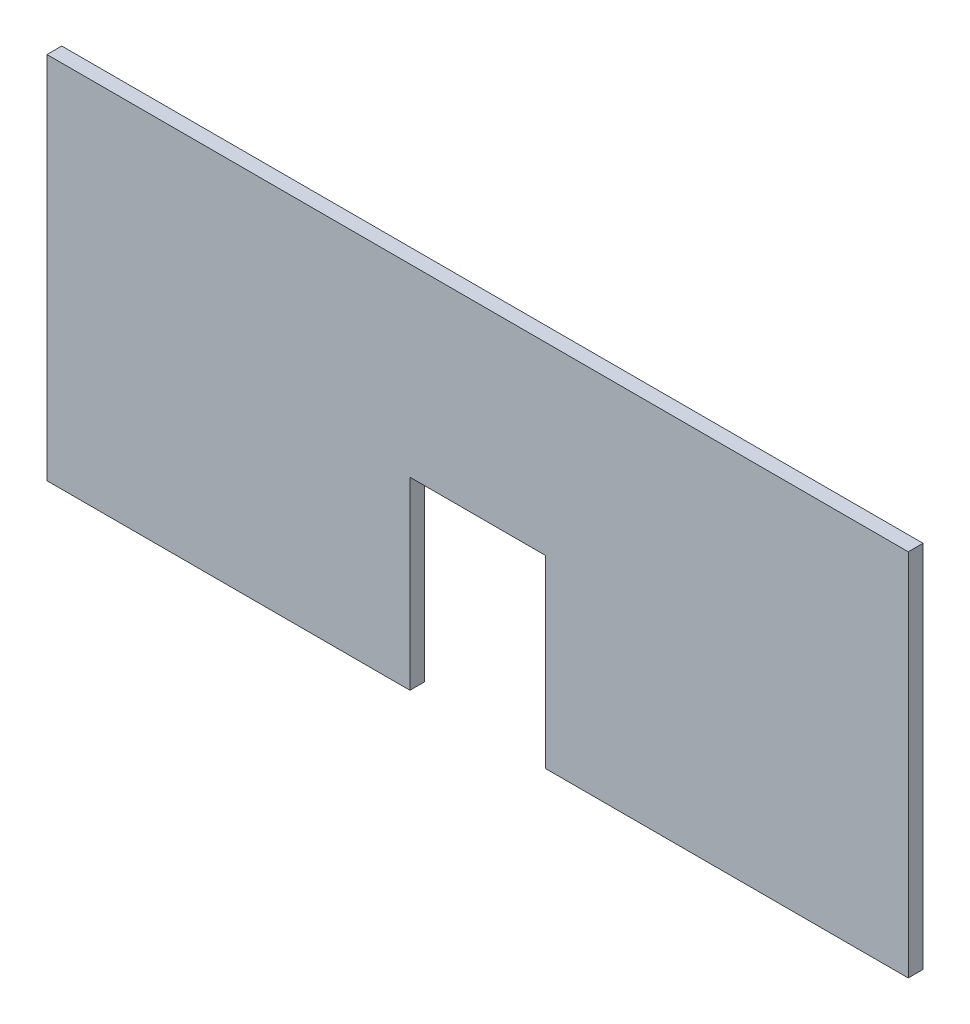
ISO-10303-21;
HEADER;
FILE_DESCRIPTION(('STEP AP214'),'2;1');
FILE_NAME('part.step','',(''),(''),'','','');
FILE_SCHEMA(('AUTOMOTIVE_DESIGN { 1 0 10303 214 1 1 1 1 }'));
ENDSEC;
DATA;
#1=APPLICATION_CONTEXT('core data for automotive mechanical design processes');
#2=APPLICATION_PROTOCOL_DEFINITION('international standard','automotive_design',2000,#1);
#3=PRODUCT_CONTEXT('',#1,'mechanical');
#4=PRODUCT('Part','Part','',(#3));
#5=PRODUCT_RELATED_PRODUCT_CATEGORY('part','',(#4));
#6=PRODUCT_DEFINITION_FORMATION('','',#4);
#7=PRODUCT_DEFINITION_CONTEXT('part definition',#1,'design');
#8=PRODUCT_DEFINITION('design','',#6,#7);
#9=PRODUCT_DEFINITION_SHAPE('','',#8);
#10=(LENGTH_UNIT() NAMED_UNIT(*) SI_UNIT(.MILLI.,.METRE.));
#11=(NAMED_UNIT(*) PLANE_ANGLE_UNIT() SI_UNIT($,.RADIAN.));
#12=(NAMED_UNIT(*) SI_UNIT($,.STERADIAN.) SOLID_ANGLE_UNIT());
#13=UNCERTAINTY_MEASURE_WITH_UNIT(LENGTH_MEASURE(1.E-05),#10,'distance_accuracy_value','');
#14=(GEOMETRIC_REPRESENTATION_CONTEXT(3) GLOBAL_UNCERTAINTY_ASSIGNED_CONTEXT((#13)) GLOBAL_UNIT_ASSIGNED_CONTEXT((#10,
#11,#12)) REPRESENTATION_CONTEXT('',''));
#15=CARTESIAN_POINT('',(0.,0.,0.));
#16=DIRECTION('',(0.,0.,1.));
#17=DIRECTION('',(1.,0.,0.));
#18=AXIS2_PLACEMENT_3D('',#15,#16,#17);
#19=CARTESIAN_POINT('',(295.,150.,12.));
#20=DIRECTION('',(-1.,0.,0.));
#21=DIRECTION('',(0.,0.,1.));
#22=AXIS2_PLACEMENT_3D('',#19,#20,#21);
#23=PLANE('',#22);
#24=DIRECTION('',(0.,1.,0.));
#25=VECTOR('',#24,1.);
#26=CARTESIAN_POINT('',(295.,150.,0.));
#27=LINE('',#26,#25);
#28=CARTESIAN_POINT('',(295.,0.,0.));
#29=VERTEX_POINT('',#28);
#30=CARTESIAN_POINT('',(295.,150.,0.));
#31=VERTEX_POINT('',#30);
#32=EDGE_CURVE('E146',#29,#31,#27,.T.);
#33=ORIENTED_EDGE('',*,*,#32,.T.);
#34=DIRECTION('',(0.,0.,-1.));
#35=VECTOR('',#34,1.);
#36=CARTESIAN_POINT('',(295.,150.,12.));
#37=LINE('',#36,#35);
#38=CARTESIAN_POINT('',(295.,150.,12.));
#39=VERTEX_POINT('',#38);
#40=EDGE_CURVE('E11',#39,#31,#37,.T.);
#41=ORIENTED_EDGE('',*,*,#40,.F.);
#42=DIRECTION('',(0.,1.,0.));
#43=VECTOR('',#42,1.);
#44=CARTESIAN_POINT('',(295.,150.,12.));
#45=LINE('',#44,#43);
#46=CARTESIAN_POINT('',(295.,0.,12.));
#47=VERTEX_POINT('',#46);
#48=EDGE_CURVE('E168',#47,#39,#45,.T.);
#49=ORIENTED_EDGE('',*,*,#48,.F.);
#50=DIRECTION('',(0.,0.,-1.));
#51=VECTOR('',#50,1.);
#52=CARTESIAN_POINT('',(295.,0.,12.));
#53=LINE('',#52,#51);
#54=EDGE_CURVE('E142',#47,#29,#53,.T.);
#55=ORIENTED_EDGE('',*,*,#54,.T.);
#56=EDGE_LOOP('',(#33,#41,#49,#55));
#57=FACE_BOUND('',#56,.T.);
#58=ADVANCED_FACE('F45',(#57),#23,.F.);
#59=CARTESIAN_POINT('',(295.,150.,12.));
#60=DIRECTION('',(0.,1.,0.));
#61=DIRECTION('',(-1.,0.,0.));
#62=AXIS2_PLACEMENT_3D('',#59,#60,#61);
#63=PLANE('',#62);
#64=DIRECTION('',(1.,0.,0.));
#65=VECTOR('',#64,1.);
#66=CARTESIAN_POINT('',(295.,150.,0.));
#67=LINE('',#66,#65);
#68=CARTESIAN_POINT('',(405.,150.,0.));
#69=VERTEX_POINT('',#68);
#70=EDGE_CURVE('E150',#31,#69,#67,.T.);
#71=ORIENTED_EDGE('',*,*,#70,.T.);
#72=DIRECTION('',(0.,0.,-1.));
#73=VECTOR('',#72,1.);
#74=CARTESIAN_POINT('',(405.,150.,12.));
#75=LINE('',#74,#73);
#76=CARTESIAN_POINT('',(405.,150.,12.));
#77=VERTEX_POINT('',#76);
#78=EDGE_CURVE('E54',#77,#69,#75,.T.);
#79=ORIENTED_EDGE('',*,*,#78,.F.);
#80=DIRECTION('',(1.,0.,0.));
#81=VECTOR('',#80,1.);
#82=CARTESIAN_POINT('',(295.,150.,12.));
#83=LINE('',#82,#81);
#84=EDGE_CURVE('E105',#39,#77,#83,.T.);
#85=ORIENTED_EDGE('',*,*,#84,.F.);
#86=ORIENTED_EDGE('',*,*,#40,.T.);
#87=EDGE_LOOP('',(#71,#79,#85,#86));
#88=FACE_BOUND('',#87,.T.);
#89=ADVANCED_FACE('F214',(#88),#63,.F.);
#90=CARTESIAN_POINT('',(405.,150.,12.));
#91=DIRECTION('',(1.,0.,0.));
#92=DIRECTION('',(0.,0.,-1.));
#93=AXIS2_PLACEMENT_3D('',#90,#91,#92);
#94=PLANE('',#93);
#95=DIRECTION('',(0.,-1.,0.));
#96=VECTOR('',#95,1.);
#97=CARTESIAN_POINT('',(405.,150.,0.));
#98=LINE('',#97,#96);
#99=CARTESIAN_POINT('',(405.,0.,0.));
#100=VERTEX_POINT('',#99);
#101=EDGE_CURVE('E153',#69,#100,#98,.T.);
#102=ORIENTED_EDGE('',*,*,#101,.T.);
#103=DIRECTION('',(0.,0.,-1.));
#104=VECTOR('',#103,1.);
#105=CARTESIAN_POINT('',(405.,0.,12.));
#106=LINE('',#105,#104);
#107=CARTESIAN_POINT('',(405.,0.,12.));
#108=VERTEX_POINT('',#107);
#109=EDGE_CURVE('E179',#108,#100,#106,.T.);
#110=ORIENTED_EDGE('',*,*,#109,.F.);
#111=DIRECTION('',(0.,-1.,0.));
#112=VECTOR('',#111,1.);
#113=CARTESIAN_POINT('',(405.,150.,12.));
#114=LINE('',#113,#112);
#115=EDGE_CURVE('E189',#77,#108,#114,.T.);
#116=ORIENTED_EDGE('',*,*,#115,.F.);
#117=ORIENTED_EDGE('',*,*,#78,.T.);
#118=EDGE_LOOP('',(#102,#110,#116,#117));
#119=FACE_BOUND('',#118,.T.);
#120=ADVANCED_FACE('F187',(#119),#94,.F.);
#121=CARTESIAN_POINT('',(405.,0.,12.));
#122=DIRECTION('',(0.,1.,0.));
#123=DIRECTION('',(0.,0.,1.));
#124=AXIS2_PLACEMENT_3D('',#121,#122,#123);
#125=PLANE('',#124);
#126=DIRECTION('',(1.,0.,0.));
#127=VECTOR('',#126,1.);
#128=CARTESIAN_POINT('',(405.,0.,0.));
#129=LINE('',#128,#127);
#130=CARTESIAN_POINT('',(700.,0.,0.));
#131=VERTEX_POINT('',#130);
#132=EDGE_CURVE('E156',#100,#131,#129,.T.);
#133=ORIENTED_EDGE('',*,*,#132,.T.);
#134=DIRECTION('',(0.,0.,-1.));
#135=VECTOR('',#134,1.);
#136=CARTESIAN_POINT('',(700.,0.,12.));
#137=LINE('',#136,#135);
#138=CARTESIAN_POINT('',(700.,0.,12.));
#139=VERTEX_POINT('',#138);
#140=EDGE_CURVE('E175',#139,#131,#137,.T.);
#141=ORIENTED_EDGE('',*,*,#140,.F.);
#142=DIRECTION('',(1.,0.,0.));
#143=VECTOR('',#142,1.);
#144=CARTESIAN_POINT('',(405.,0.,12.));
#145=LINE('',#144,#143);
#146=EDGE_CURVE('E202',#108,#139,#145,.T.);
#147=ORIENTED_EDGE('',*,*,#146,.F.);
#148=ORIENTED_EDGE('',*,*,#109,.T.);
#149=EDGE_LOOP('',(#133,#141,#147,#148));
#150=FACE_BOUND('',#149,.T.);
#151=ADVANCED_FACE('F197',(#150),#125,.F.);
#152=CARTESIAN_POINT('',(700.,300.,12.));
#153=DIRECTION('',(-1.,0.,0.));
#154=DIRECTION('',(0.,0.,1.));
#155=AXIS2_PLACEMENT_3D('',#152,#153,#154);
#156=PLANE('',#155);
#157=DIRECTION('',(0.,1.,0.));
#158=VECTOR('',#157,1.);
#159=CARTESIAN_POINT('',(700.,300.,0.));
#160=LINE('',#159,#158);
#161=CARTESIAN_POINT('',(700.,300.,0.));
#162=VERTEX_POINT('',#161);
#163=EDGE_CURVE('E159',#131,#162,#160,.T.);
#164=ORIENTED_EDGE('',*,*,#163,.T.);
#165=DIRECTION('',(0.,0.,-1.));
#166=VECTOR('',#165,1.);
#167=CARTESIAN_POINT('',(700.,300.,12.));
#168=LINE('',#167,#166);
#169=CARTESIAN_POINT('',(700.,300.,12.));
#170=VERTEX_POINT('',#169);
#171=EDGE_CURVE('E135',#170,#162,#168,.T.);
#172=ORIENTED_EDGE('',*,*,#171,.F.);
#173=DIRECTION('',(0.,1.,0.));
#174=VECTOR('',#173,1.);
#175=CARTESIAN_POINT('',(700.,300.,12.));
#176=LINE('',#175,#174);
#177=EDGE_CURVE('E124',#139,#170,#176,.T.);
#178=ORIENTED_EDGE('',*,*,#177,.F.);
#179=ORIENTED_EDGE('',*,*,#140,.T.);
#180=EDGE_LOOP('',(#164,#172,#178,#179));
#181=FACE_BOUND('',#180,.T.);
#182=ADVANCED_FACE('F200',(#181),#156,.F.);
#183=CARTESIAN_POINT('',(0.,300.,12.));
#184=DIRECTION('',(0.,-1.,0.));
#185=DIRECTION('',(0.,0.,-1.));
#186=AXIS2_PLACEMENT_3D('',#183,#184,#185);
#187=PLANE('',#186);
#188=DIRECTION('',(-1.,0.,0.));
#189=VECTOR('',#188,1.);
#190=CARTESIAN_POINT('',(0.,300.,0.));
#191=LINE('',#190,#189);
#192=CARTESIAN_POINT('',(0.,300.,0.));
#193=VERTEX_POINT('',#192);
#194=EDGE_CURVE('E133',#162,#193,#191,.T.);
#195=ORIENTED_EDGE('',*,*,#194,.T.);
#196=DIRECTION('',(0.,0.,-1.));
#197=VECTOR('',#196,1.);
#198=CARTESIAN_POINT('',(0.,300.,12.));
#199=LINE('',#198,#197);
#200=CARTESIAN_POINT('',(0.,300.,12.));
#201=VERTEX_POINT('',#200);
#202=EDGE_CURVE('E130',#201,#193,#199,.T.);
#203=ORIENTED_EDGE('',*,*,#202,.F.);
#204=DIRECTION('',(-1.,0.,0.));
#205=VECTOR('',#204,1.);
#206=CARTESIAN_POINT('',(0.,300.,12.));
#207=LINE('',#206,#205);
#208=EDGE_CURVE('E118',#170,#201,#207,.T.);
#209=ORIENTED_EDGE('',*,*,#208,.F.);
#210=ORIENTED_EDGE('',*,*,#171,.T.);
#211=EDGE_LOOP('',(#195,#203,#209,#210));
#212=FACE_BOUND('',#211,.T.);
#213=ADVANCED_FACE('F131',(#212),#187,.F.);
#214=CARTESIAN_POINT('',(0.,300.,12.));
#215=DIRECTION('',(1.,0.,0.));
#216=DIRECTION('',(0.,1.,0.));
#217=AXIS2_PLACEMENT_3D('',#214,#215,#216);
#218=PLANE('',#217);
#219=DIRECTION('',(0.,-1.,0.));
#220=VECTOR('',#219,1.);
#221=CARTESIAN_POINT('',(0.,300.,0.));
#222=LINE('',#221,#220);
#223=CARTESIAN_POINT('',(0.,0.,0.));
#224=VERTEX_POINT('',#223);
#225=EDGE_CURVE('E91',#193,#224,#222,.T.);
#226=ORIENTED_EDGE('',*,*,#225,.T.);
#227=DIRECTION('',(0.,0.,-1.));
#228=VECTOR('',#227,1.);
#229=CARTESIAN_POINT('',(0.,0.,12.));
#230=LINE('',#229,#228);
#231=CARTESIAN_POINT('',(0.,0.,12.));
#232=VERTEX_POINT('',#231);
#233=EDGE_CURVE('E136',#232,#224,#230,.T.);
#234=ORIENTED_EDGE('',*,*,#233,.F.);
#235=DIRECTION('',(0.,-1.,0.));
#236=VECTOR('',#235,1.);
#237=CARTESIAN_POINT('',(0.,300.,12.));
#238=LINE('',#237,#236);
#239=EDGE_CURVE('E122',#201,#232,#238,.T.);
#240=ORIENTED_EDGE('',*,*,#239,.F.);
#241=ORIENTED_EDGE('',*,*,#202,.T.);
#242=EDGE_LOOP('',(#226,#234,#240,#241));
#243=FACE_BOUND('',#242,.T.);
#244=ADVANCED_FACE('F138',(#243),#218,.F.);
#245=CARTESIAN_POINT('',(0.,0.,12.));
#246=DIRECTION('',(0.,1.,0.));
#247=DIRECTION('',(0.,0.,1.));
#248=AXIS2_PLACEMENT_3D('',#245,#246,#247);
#249=PLANE('',#248);
#250=DIRECTION('',(1.,0.,0.));
#251=VECTOR('',#250,1.);
#252=CARTESIAN_POINT('',(0.,0.,0.));
#253=LINE('',#252,#251);
#254=EDGE_CURVE('E97',#224,#29,#253,.T.);
#255=ORIENTED_EDGE('',*,*,#254,.T.);
#256=ORIENTED_EDGE('',*,*,#54,.F.);
#257=DIRECTION('',(1.,0.,0.));
#258=VECTOR('',#257,1.);
#259=CARTESIAN_POINT('',(0.,0.,12.));
#260=LINE('',#259,#258);
#261=EDGE_CURVE('E62',#232,#47,#260,.T.);
#262=ORIENTED_EDGE('',*,*,#261,.F.);
#263=ORIENTED_EDGE('',*,*,#233,.T.);
#264=EDGE_LOOP('',(#255,#256,#262,#263));
#265=FACE_BOUND('',#264,.T.);
#266=ADVANCED_FACE('F230',(#265),#249,.F.);
#267=CARTESIAN_POINT('',(0.,0.,12.));
#268=DIRECTION('',(0.,0.,1.));
#269=DIRECTION('',(1.,0.,0.));
#270=AXIS2_PLACEMENT_3D('',#267,#268,#269);
#271=PLANE('',#270);
#272=ORIENTED_EDGE('',*,*,#48,.T.);
#273=ORIENTED_EDGE('',*,*,#84,.T.);
#274=ORIENTED_EDGE('',*,*,#115,.T.);
#275=ORIENTED_EDGE('',*,*,#146,.T.);
#276=ORIENTED_EDGE('',*,*,#177,.T.);
#277=ORIENTED_EDGE('',*,*,#208,.T.);
#278=ORIENTED_EDGE('',*,*,#239,.T.);
#279=ORIENTED_EDGE('',*,*,#261,.T.);
#280=EDGE_LOOP('',(#272,#273,#274,#275,#276,#277,#278,#279));
#281=FACE_BOUND('',#280,.T.);
#282=ADVANCED_FACE('F120',(#281),#271,.T.);
#283=CARTESIAN_POINT('',(0.,0.,0.));
#284=DIRECTION('',(0.,0.,1.));
#285=DIRECTION('',(1.,0.,0.));
#286=AXIS2_PLACEMENT_3D('',#283,#284,#285);
#287=PLANE('',#286);
#288=ORIENTED_EDGE('',*,*,#32,.F.);
#289=ORIENTED_EDGE('',*,*,#254,.F.);
#290=ORIENTED_EDGE('',*,*,#225,.F.);
#291=ORIENTED_EDGE('',*,*,#194,.F.);
#292=ORIENTED_EDGE('',*,*,#163,.F.);
#293=ORIENTED_EDGE('',*,*,#132,.F.);
#294=ORIENTED_EDGE('',*,*,#101,.F.);
#295=ORIENTED_EDGE('',*,*,#70,.F.);
#296=EDGE_LOOP('',(#288,#289,#290,#291,#292,#293,#294,#295));
#297=FACE_BOUND('',#296,.T.);
#298=ADVANCED_FACE('F193',(#297),#287,.F.);
#299=CLOSED_SHELL('',(#58,#89,#120,#151,#182,#213,#244,#266,#282,#298));
#300=MANIFOLD_SOLID_BREP('B2',#299);
#301=ADVANCED_BREP_SHAPE_REPRESENTATION('',(#18,#300),#14);
#302=SHAPE_DEFINITION_REPRESENTATION(#9,#301);
ENDSEC;
END-ISO-10303-21;
